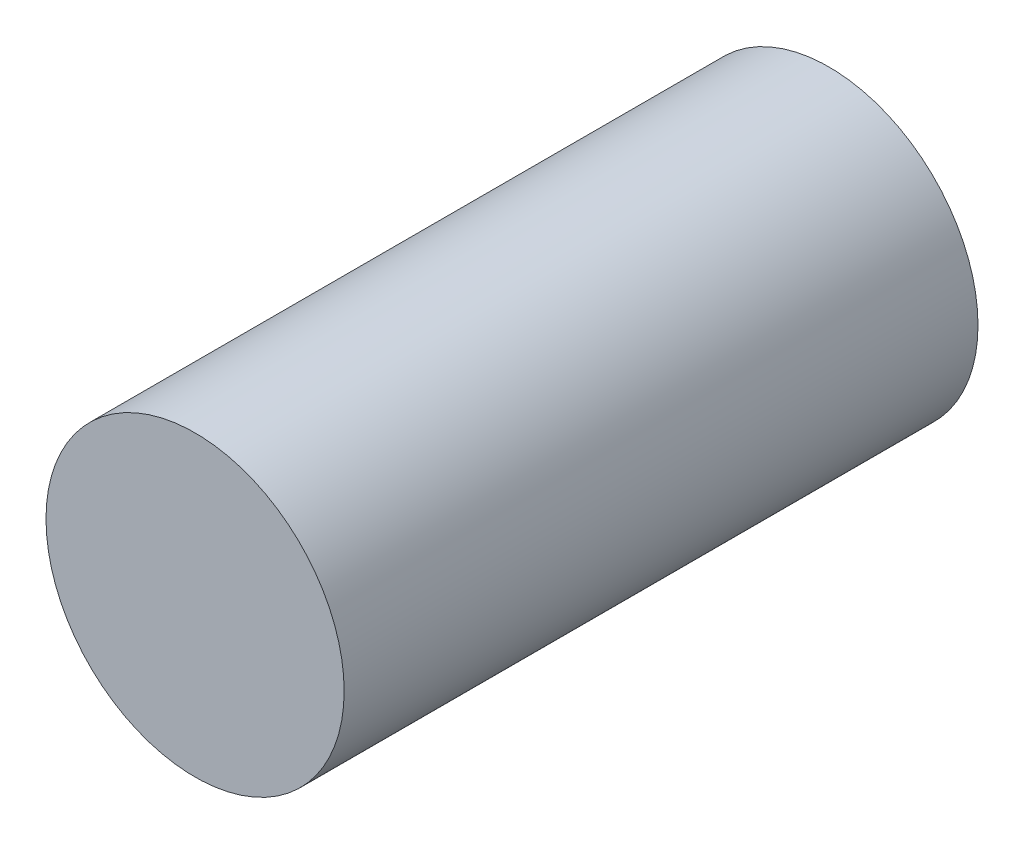
ISO-10303-21;
HEADER;
FILE_DESCRIPTION(('STEP AP214'),'2;1');
FILE_NAME('part.step','',(''),(''),'','','');
FILE_SCHEMA(('AUTOMOTIVE_DESIGN { 1 0 10303 214 1 1 1 1 }'));
ENDSEC;
DATA;
#1=APPLICATION_CONTEXT('core data for automotive mechanical design processes');
#2=APPLICATION_PROTOCOL_DEFINITION('international standard','automotive_design',2000,#1);
#3=PRODUCT_CONTEXT('',#1,'mechanical');
#4=PRODUCT('Part','Part','',(#3));
#5=PRODUCT_RELATED_PRODUCT_CATEGORY('part','',(#4));
#6=PRODUCT_DEFINITION_FORMATION('','',#4);
#7=PRODUCT_DEFINITION_CONTEXT('part definition',#1,'design');
#8=PRODUCT_DEFINITION('design','',#6,#7);
#9=PRODUCT_DEFINITION_SHAPE('','',#8);
#10=(LENGTH_UNIT() NAMED_UNIT(*) SI_UNIT(.MILLI.,.METRE.));
#11=(NAMED_UNIT(*) PLANE_ANGLE_UNIT() SI_UNIT($,.RADIAN.));
#12=(NAMED_UNIT(*) SI_UNIT($,.STERADIAN.) SOLID_ANGLE_UNIT());
#13=UNCERTAINTY_MEASURE_WITH_UNIT(LENGTH_MEASURE(1.E-05),#10,'distance_accuracy_value','');
#14=(GEOMETRIC_REPRESENTATION_CONTEXT(3) GLOBAL_UNCERTAINTY_ASSIGNED_CONTEXT((#13)) GLOBAL_UNIT_ASSIGNED_CONTEXT((#10,
#11,#12)) REPRESENTATION_CONTEXT('',''));
#15=CARTESIAN_POINT('',(0.,0.,0.));
#16=DIRECTION('',(0.,0.,1.));
#17=DIRECTION('',(1.,0.,0.));
#18=AXIS2_PLACEMENT_3D('',#15,#16,#17);
#19=CARTESIAN_POINT('',(0.,0.,0.));
#20=DIRECTION('',(0.,0.,-1.));
#21=DIRECTION('',(-1.,0.,0.));
#22=AXIS2_PLACEMENT_3D('',#19,#20,#21);
#23=PLANE('',#22);
#24=CARTESIAN_POINT('',(0.,0.,0.));
#25=DIRECTION('',(0.,0.,1.));
#26=DIRECTION('',(1.,0.,0.));
#27=AXIS2_PLACEMENT_3D('',#24,#25,#26);
#28=CIRCLE('',#27,3.175);
#29=CARTESIAN_POINT('',(3.175,0.,0.));
#30=VERTEX_POINT('',#29);
#31=EDGE_CURVE('E17',#30,#30,#28,.T.);
#32=ORIENTED_EDGE('',*,*,#31,.F.);
#33=EDGE_LOOP('',(#32));
#34=FACE_BOUND('',#33,.T.);
#35=ADVANCED_FACE('F14',(#34),#23,.T.);
#36=CARTESIAN_POINT('',(0.,0.,13.5));
#37=DIRECTION('',(0.,0.,-1.));
#38=DIRECTION('',(-1.,0.,0.));
#39=AXIS2_PLACEMENT_3D('',#36,#37,#38);
#40=PLANE('',#39);
#41=CARTESIAN_POINT('',(0.,0.,13.5));
#42=DIRECTION('',(0.,0.,1.));
#43=DIRECTION('',(1.,0.,0.));
#44=AXIS2_PLACEMENT_3D('',#41,#42,#43);
#45=CIRCLE('',#44,3.175);
#46=CARTESIAN_POINT('',(3.175,0.,13.5));
#47=VERTEX_POINT('',#46);
#48=EDGE_CURVE('E9',#47,#47,#45,.F.);
#49=ORIENTED_EDGE('',*,*,#48,.F.);
#50=EDGE_LOOP('',(#49));
#51=FACE_BOUND('',#50,.T.);
#52=ADVANCED_FACE('F29',(#51),#40,.F.);
#53=CARTESIAN_POINT('',(0.,0.,0.));
#54=DIRECTION('',(0.,0.,1.));
#55=DIRECTION('',(1.,0.,0.));
#56=AXIS2_PLACEMENT_3D('',#53,#54,#55);
#57=CYLINDRICAL_SURFACE('',#56,3.175);
#58=ORIENTED_EDGE('',*,*,#48,.T.);
#59=EDGE_LOOP('',(#58));
#60=FACE_BOUND('',#59,.T.);
#61=ORIENTED_EDGE('',*,*,#31,.T.);
#62=EDGE_LOOP('',(#61));
#63=FACE_BOUND('',#62,.T.);
#64=ADVANCED_FACE('F26',(#60,#63),#57,.T.);
#65=CLOSED_SHELL('',(#35,#52,#64));
#66=MANIFOLD_SOLID_BREP('B1',#65);
#67=ADVANCED_BREP_SHAPE_REPRESENTATION('',(#18,#66),#14);
#68=SHAPE_DEFINITION_REPRESENTATION(#9,#67);
ENDSEC;
END-ISO-10303-21;
